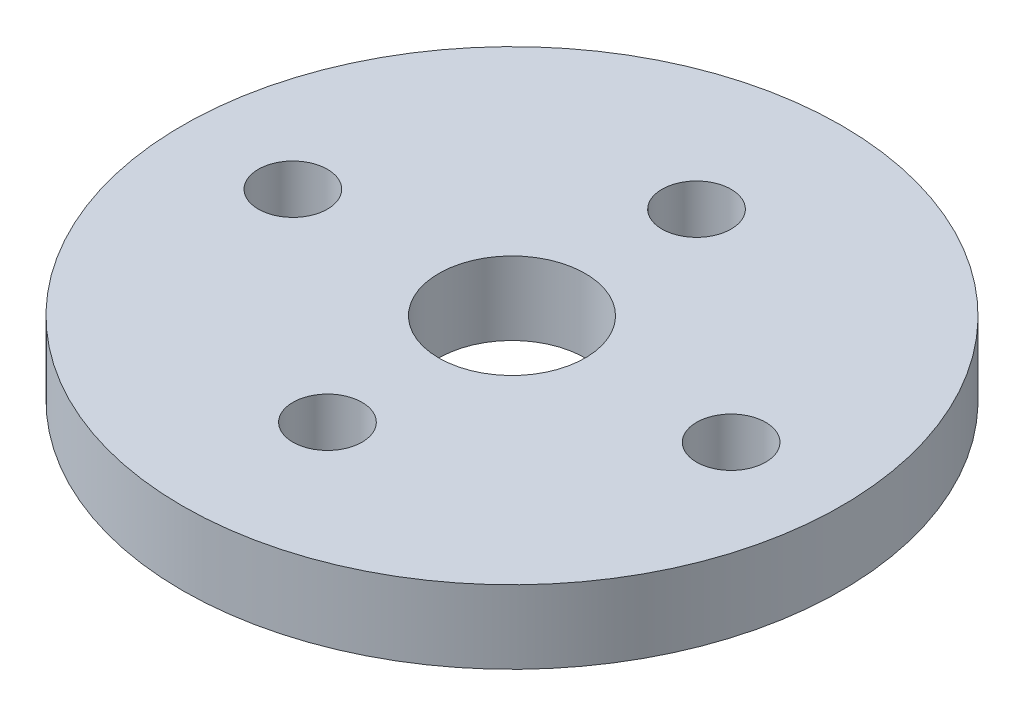
ISO-10303-21;
HEADER;
FILE_DESCRIPTION(('STEP AP214'),'2;1');
FILE_NAME('part.step','',(''),(''),'','','');
FILE_SCHEMA(('AUTOMOTIVE_DESIGN { 1 0 10303 214 1 1 1 1 }'));
ENDSEC;
DATA;
#1=APPLICATION_CONTEXT('core data for automotive mechanical design processes');
#2=APPLICATION_PROTOCOL_DEFINITION('international standard','automotive_design',2000,#1);
#3=PRODUCT_CONTEXT('',#1,'mechanical');
#4=PRODUCT('Part','Part','',(#3));
#5=PRODUCT_RELATED_PRODUCT_CATEGORY('part','',(#4));
#6=PRODUCT_DEFINITION_FORMATION('','',#4);
#7=PRODUCT_DEFINITION_CONTEXT('part definition',#1,'design');
#8=PRODUCT_DEFINITION('design','',#6,#7);
#9=PRODUCT_DEFINITION_SHAPE('','',#8);
#10=(LENGTH_UNIT() NAMED_UNIT(*) SI_UNIT(.MILLI.,.METRE.));
#11=(NAMED_UNIT(*) PLANE_ANGLE_UNIT() SI_UNIT($,.RADIAN.));
#12=(NAMED_UNIT(*) SI_UNIT($,.STERADIAN.) SOLID_ANGLE_UNIT());
#13=UNCERTAINTY_MEASURE_WITH_UNIT(LENGTH_MEASURE(1.E-05),#10,'distance_accuracy_value','');
#14=(GEOMETRIC_REPRESENTATION_CONTEXT(3) GLOBAL_UNCERTAINTY_ASSIGNED_CONTEXT((#13)) GLOBAL_UNIT_ASSIGNED_CONTEXT((#10,
#11,#12)) REPRESENTATION_CONTEXT('',''));
#15=CARTESIAN_POINT('',(0.,0.,0.));
#16=DIRECTION('',(0.,0.,1.));
#17=DIRECTION('',(1.,0.,0.));
#18=AXIS2_PLACEMENT_3D('',#15,#16,#17);
#19=CARTESIAN_POINT('',(0.,3.175,0.));
#20=DIRECTION('',(0.,1.,0.));
#21=DIRECTION('',(0.,0.,1.));
#22=AXIS2_PLACEMENT_3D('',#19,#20,#21);
#23=PLANE('',#22);
#24=CARTESIAN_POINT('',(-9.5,3.175,0.));
#25=DIRECTION('',(0.,1.,0.));
#26=DIRECTION('',(0.,0.,1.));
#27=AXIS2_PLACEMENT_3D('',#24,#25,#26);
#28=CIRCLE('',#27,1.4986);
#29=CARTESIAN_POINT('',(-9.5,3.175,1.4986));
#30=VERTEX_POINT('',#29);
#31=EDGE_CURVE('E61',#30,#30,#28,.T.);
#32=ORIENTED_EDGE('',*,*,#31,.F.);
#33=EDGE_LOOP('',(#32));
#34=FACE_BOUND('',#33,.T.);
#35=CARTESIAN_POINT('',(9.5,3.175,0.));
#36=DIRECTION('',(0.,1.,0.));
#37=DIRECTION('',(0.,0.,1.));
#38=AXIS2_PLACEMENT_3D('',#35,#36,#37);
#39=CIRCLE('',#38,1.4986);
#40=CARTESIAN_POINT('',(9.5,3.175,1.4986));
#41=VERTEX_POINT('',#40);
#42=EDGE_CURVE('E49',#41,#41,#39,.T.);
#43=ORIENTED_EDGE('',*,*,#42,.F.);
#44=EDGE_LOOP('',(#43));
#45=FACE_BOUND('',#44,.T.);
#46=CARTESIAN_POINT('',(0.,3.175,0.));
#47=DIRECTION('',(0.,1.,0.));
#48=DIRECTION('',(0.,0.,1.));
#49=AXIS2_PLACEMENT_3D('',#46,#47,#48);
#50=CIRCLE('',#49,14.2875);
#51=CARTESIAN_POINT('',(0.,3.175,14.2875));
#52=VERTEX_POINT('',#51);
#53=EDGE_CURVE('E10',#52,#52,#50,.T.);
#54=ORIENTED_EDGE('',*,*,#53,.T.);
#55=EDGE_LOOP('',(#54));
#56=FACE_BOUND('',#55,.T.);
#57=CARTESIAN_POINT('',(0.,3.175,-8.));
#58=DIRECTION('',(0.,1.,0.));
#59=DIRECTION('',(0.,0.,1.));
#60=AXIS2_PLACEMENT_3D('',#57,#58,#59);
#61=CIRCLE('',#60,1.4986);
#62=CARTESIAN_POINT('',(0.,3.175,-6.5014));
#63=VERTEX_POINT('',#62);
#64=EDGE_CURVE('E44',#63,#63,#61,.T.);
#65=ORIENTED_EDGE('',*,*,#64,.F.);
#66=EDGE_LOOP('',(#65));
#67=FACE_BOUND('',#66,.T.);
#68=CARTESIAN_POINT('',(0.,3.175,8.));
#69=DIRECTION('',(0.,1.,0.));
#70=DIRECTION('',(0.,0.,1.));
#71=AXIS2_PLACEMENT_3D('',#68,#69,#70);
#72=CIRCLE('',#71,1.4986);
#73=CARTESIAN_POINT('',(0.,3.175,9.4986));
#74=VERTEX_POINT('',#73);
#75=EDGE_CURVE('E55',#74,#74,#72,.T.);
#76=ORIENTED_EDGE('',*,*,#75,.F.);
#77=EDGE_LOOP('',(#76));
#78=FACE_BOUND('',#77,.T.);
#79=CARTESIAN_POINT('',(0.,3.175,0.));
#80=DIRECTION('',(0.,1.,0.));
#81=DIRECTION('',(0.,0.,1.));
#82=AXIS2_PLACEMENT_3D('',#79,#80,#81);
#83=CIRCLE('',#82,3.175);
#84=CARTESIAN_POINT('',(0.,3.175,3.175));
#85=VERTEX_POINT('',#84);
#86=EDGE_CURVE('E67',#85,#85,#83,.T.);
#87=ORIENTED_EDGE('',*,*,#86,.F.);
#88=EDGE_LOOP('',(#87));
#89=FACE_BOUND('',#88,.T.);
#90=ADVANCED_FACE('F33',(#34,#45,#56,#67,#78,#89),#23,.T.);
#91=CARTESIAN_POINT('',(0.,0.,0.));
#92=DIRECTION('',(0.,1.,0.));
#93=DIRECTION('',(0.,0.,1.));
#94=AXIS2_PLACEMENT_3D('',#91,#92,#93);
#95=PLANE('',#94);
#96=CARTESIAN_POINT('',(0.,0.,0.));
#97=DIRECTION('',(0.,1.,0.));
#98=DIRECTION('',(0.,0.,1.));
#99=AXIS2_PLACEMENT_3D('',#96,#97,#98);
#100=CIRCLE('',#99,14.2875);
#101=CARTESIAN_POINT('',(0.,0.,14.2875));
#102=VERTEX_POINT('',#101);
#103=EDGE_CURVE('E37',#102,#102,#100,.T.);
#104=ORIENTED_EDGE('',*,*,#103,.F.);
#105=EDGE_LOOP('',(#104));
#106=FACE_BOUND('',#105,.T.);
#107=CARTESIAN_POINT('',(0.,0.,-8.));
#108=DIRECTION('',(0.,1.,0.));
#109=DIRECTION('',(0.,0.,1.));
#110=AXIS2_PLACEMENT_3D('',#107,#108,#109);
#111=CIRCLE('',#110,1.4986);
#112=CARTESIAN_POINT('',(0.,0.,-6.5014));
#113=VERTEX_POINT('',#112);
#114=EDGE_CURVE('E46',#113,#113,#111,.T.);
#115=ORIENTED_EDGE('',*,*,#114,.T.);
#116=EDGE_LOOP('',(#115));
#117=FACE_BOUND('',#116,.T.);
#118=CARTESIAN_POINT('',(9.5,0.,0.));
#119=DIRECTION('',(0.,1.,0.));
#120=DIRECTION('',(0.,0.,1.));
#121=AXIS2_PLACEMENT_3D('',#118,#119,#120);
#122=CIRCLE('',#121,1.4986);
#123=CARTESIAN_POINT('',(9.5,0.,1.4986));
#124=VERTEX_POINT('',#123);
#125=EDGE_CURVE('E52',#124,#124,#122,.T.);
#126=ORIENTED_EDGE('',*,*,#125,.T.);
#127=EDGE_LOOP('',(#126));
#128=FACE_BOUND('',#127,.T.);
#129=CARTESIAN_POINT('',(0.,0.,8.));
#130=DIRECTION('',(0.,1.,0.));
#131=DIRECTION('',(0.,0.,1.));
#132=AXIS2_PLACEMENT_3D('',#129,#130,#131);
#133=CIRCLE('',#132,1.4986);
#134=CARTESIAN_POINT('',(0.,0.,9.4986));
#135=VERTEX_POINT('',#134);
#136=EDGE_CURVE('E58',#135,#135,#133,.T.);
#137=ORIENTED_EDGE('',*,*,#136,.T.);
#138=EDGE_LOOP('',(#137));
#139=FACE_BOUND('',#138,.T.);
#140=CARTESIAN_POINT('',(-9.5,0.,0.));
#141=DIRECTION('',(0.,1.,0.));
#142=DIRECTION('',(0.,0.,1.));
#143=AXIS2_PLACEMENT_3D('',#140,#141,#142);
#144=CIRCLE('',#143,1.4986);
#145=CARTESIAN_POINT('',(-9.5,0.,1.4986));
#146=VERTEX_POINT('',#145);
#147=EDGE_CURVE('E64',#146,#146,#144,.T.);
#148=ORIENTED_EDGE('',*,*,#147,.T.);
#149=EDGE_LOOP('',(#148));
#150=FACE_BOUND('',#149,.T.);
#151=CARTESIAN_POINT('',(0.,0.,0.));
#152=DIRECTION('',(0.,1.,0.));
#153=DIRECTION('',(0.,0.,1.));
#154=AXIS2_PLACEMENT_3D('',#151,#152,#153);
#155=CIRCLE('',#154,3.175);
#156=CARTESIAN_POINT('',(0.,0.,3.175));
#157=VERTEX_POINT('',#156);
#158=EDGE_CURVE('E70',#157,#157,#155,.T.);
#159=ORIENTED_EDGE('',*,*,#158,.T.);
#160=EDGE_LOOP('',(#159));
#161=FACE_BOUND('',#160,.T.);
#162=ADVANCED_FACE('F80',(#106,#117,#128,#139,#150,#161),#95,.F.);
#163=CARTESIAN_POINT('',(0.,3.175,0.));
#164=DIRECTION('',(0.,-1.,0.));
#165=DIRECTION('',(0.,0.,-1.));
#166=AXIS2_PLACEMENT_3D('',#163,#164,#165);
#167=CYLINDRICAL_SURFACE('',#166,14.2875);
#168=ORIENTED_EDGE('',*,*,#53,.F.);
#169=EDGE_LOOP('',(#168));
#170=FACE_BOUND('',#169,.T.);
#171=ORIENTED_EDGE('',*,*,#103,.T.);
#172=EDGE_LOOP('',(#171));
#173=FACE_BOUND('',#172,.T.);
#174=ADVANCED_FACE('F35',(#170,#173),#167,.T.);
#175=CARTESIAN_POINT('',(0.,3.175,-8.));
#176=DIRECTION('',(0.,-1.,0.));
#177=DIRECTION('',(0.,0.,-1.));
#178=AXIS2_PLACEMENT_3D('',#175,#176,#177);
#179=CYLINDRICAL_SURFACE('',#178,1.4986);
#180=ORIENTED_EDGE('',*,*,#64,.T.);
#181=EDGE_LOOP('',(#180));
#182=FACE_BOUND('',#181,.T.);
#183=ORIENTED_EDGE('',*,*,#114,.F.);
#184=EDGE_LOOP('',(#183));
#185=FACE_BOUND('',#184,.T.);
#186=ADVANCED_FACE('F90',(#182,#185),#179,.F.);
#187=CARTESIAN_POINT('',(9.5,3.175,0.));
#188=DIRECTION('',(0.,-1.,0.));
#189=DIRECTION('',(0.,0.,-1.));
#190=AXIS2_PLACEMENT_3D('',#187,#188,#189);
#191=CYLINDRICAL_SURFACE('',#190,1.4986);
#192=ORIENTED_EDGE('',*,*,#42,.T.);
#193=EDGE_LOOP('',(#192));
#194=FACE_BOUND('',#193,.T.);
#195=ORIENTED_EDGE('',*,*,#125,.F.);
#196=EDGE_LOOP('',(#195));
#197=FACE_BOUND('',#196,.T.);
#198=ADVANCED_FACE('F93',(#194,#197),#191,.F.);
#199=CARTESIAN_POINT('',(0.,3.175,8.));
#200=DIRECTION('',(0.,-1.,0.));
#201=DIRECTION('',(0.,0.,-1.));
#202=AXIS2_PLACEMENT_3D('',#199,#200,#201);
#203=CYLINDRICAL_SURFACE('',#202,1.4986);
#204=ORIENTED_EDGE('',*,*,#75,.T.);
#205=EDGE_LOOP('',(#204));
#206=FACE_BOUND('',#205,.T.);
#207=ORIENTED_EDGE('',*,*,#136,.F.);
#208=EDGE_LOOP('',(#207));
#209=FACE_BOUND('',#208,.T.);
#210=ADVANCED_FACE('F97',(#206,#209),#203,.F.);
#211=CARTESIAN_POINT('',(-9.5,3.175,0.));
#212=DIRECTION('',(0.,-1.,0.));
#213=DIRECTION('',(0.,0.,-1.));
#214=AXIS2_PLACEMENT_3D('',#211,#212,#213);
#215=CYLINDRICAL_SURFACE('',#214,1.4986);
#216=ORIENTED_EDGE('',*,*,#31,.T.);
#217=EDGE_LOOP('',(#216));
#218=FACE_BOUND('',#217,.T.);
#219=ORIENTED_EDGE('',*,*,#147,.F.);
#220=EDGE_LOOP('',(#219));
#221=FACE_BOUND('',#220,.T.);
#222=ADVANCED_FACE('F101',(#218,#221),#215,.F.);
#223=CARTESIAN_POINT('',(0.,3.175,0.));
#224=DIRECTION('',(0.,-1.,0.));
#225=DIRECTION('',(0.,0.,-1.));
#226=AXIS2_PLACEMENT_3D('',#223,#224,#225);
#227=CYLINDRICAL_SURFACE('',#226,3.175);
#228=ORIENTED_EDGE('',*,*,#86,.T.);
#229=EDGE_LOOP('',(#228));
#230=FACE_BOUND('',#229,.T.);
#231=ORIENTED_EDGE('',*,*,#158,.F.);
#232=EDGE_LOOP('',(#231));
#233=FACE_BOUND('',#232,.T.);
#234=ADVANCED_FACE('F76',(#230,#233),#227,.F.);
#235=CLOSED_SHELL('',(#90,#162,#174,#186,#198,#210,#222,#234));
#236=MANIFOLD_SOLID_BREP('B2',#235);
#237=ADVANCED_BREP_SHAPE_REPRESENTATION('',(#18,#236),#14);
#238=SHAPE_DEFINITION_REPRESENTATION(#9,#237);
ENDSEC;
END-ISO-10303-21;
